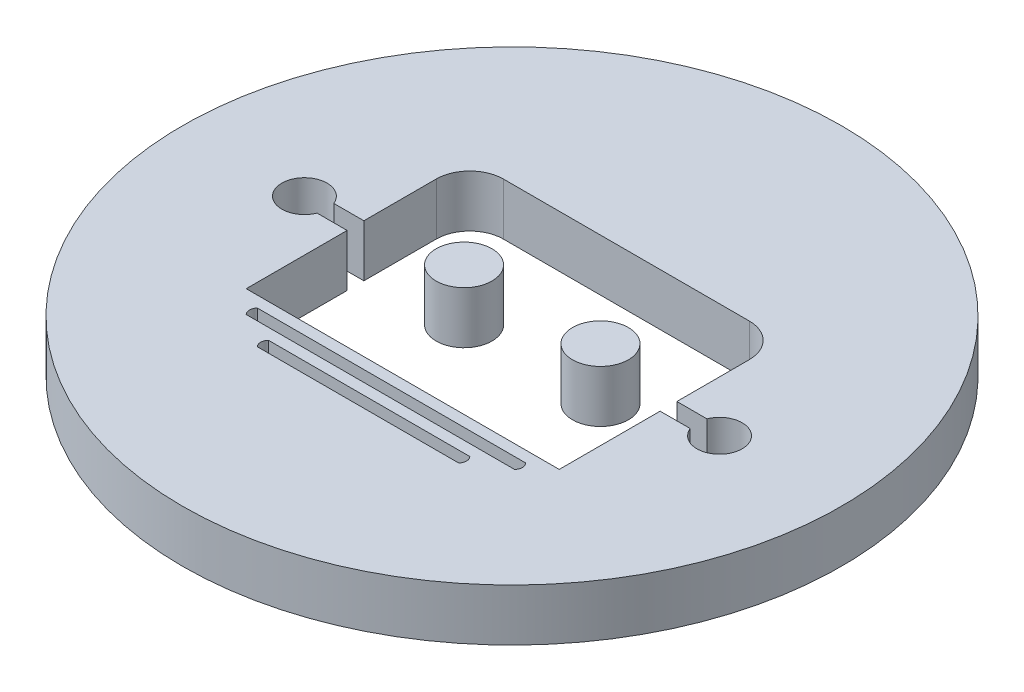
ISO-10303-21;
HEADER;
FILE_DESCRIPTION(('STEP AP214'),'2;1');
FILE_NAME('part.step','',(''),(''),'','','');
FILE_SCHEMA(('AUTOMOTIVE_DESIGN { 1 0 10303 214 1 1 1 1 }'));
ENDSEC;
DATA;
#1=APPLICATION_CONTEXT('core data for automotive mechanical design processes');
#2=APPLICATION_PROTOCOL_DEFINITION('international standard','automotive_design',2000,#1);
#3=PRODUCT_CONTEXT('',#1,'mechanical');
#4=PRODUCT('Part','Part','',(#3));
#5=PRODUCT_RELATED_PRODUCT_CATEGORY('part','',(#4));
#6=PRODUCT_DEFINITION_FORMATION('','',#4);
#7=PRODUCT_DEFINITION_CONTEXT('part definition',#1,'design');
#8=PRODUCT_DEFINITION('design','',#6,#7);
#9=PRODUCT_DEFINITION_SHAPE('','',#8);
#10=(LENGTH_UNIT() NAMED_UNIT(*) SI_UNIT(.MILLI.,.METRE.));
#11=(NAMED_UNIT(*) PLANE_ANGLE_UNIT() SI_UNIT($,.RADIAN.));
#12=(NAMED_UNIT(*) SI_UNIT($,.STERADIAN.) SOLID_ANGLE_UNIT());
#13=UNCERTAINTY_MEASURE_WITH_UNIT(LENGTH_MEASURE(1.E-05),#10,'distance_accuracy_value','');
#14=(GEOMETRIC_REPRESENTATION_CONTEXT(3) GLOBAL_UNCERTAINTY_ASSIGNED_CONTEXT((#13)) GLOBAL_UNIT_ASSIGNED_CONTEXT((#10,
#11,#12)) REPRESENTATION_CONTEXT('',''));
#15=CARTESIAN_POINT('',(0.,0.,0.));
#16=DIRECTION('',(0.,0.,1.));
#17=DIRECTION('',(1.,0.,0.));
#18=AXIS2_PLACEMENT_3D('',#15,#16,#17);
#19=CARTESIAN_POINT('',(-35.6565223605691,3.,-86.8647060918394));
#20=DIRECTION('',(0.,-1.,0.));
#21=DIRECTION('',(0.,0.,-1.));
#22=AXIS2_PLACEMENT_3D('',#19,#20,#21);
#23=CYLINDRICAL_SURFACE('',#22,19.);
#24=CARTESIAN_POINT('',(-35.6565223605691,3.,-86.8647060918394));
#25=DIRECTION('',(0.,1.,0.));
#26=DIRECTION('',(0.,0.,1.));
#27=AXIS2_PLACEMENT_3D('',#24,#25,#26);
#28=CIRCLE('',#27,19.);
#29=CARTESIAN_POINT('',(-35.6565223605691,3.,-67.8647060918394));
#30=VERTEX_POINT('',#29);
#31=EDGE_CURVE('E263',#30,#30,#28,.T.);
#32=ORIENTED_EDGE('',*,*,#31,.F.);
#33=EDGE_LOOP('',(#32));
#34=FACE_BOUND('',#33,.T.);
#35=CARTESIAN_POINT('',(-35.6565223605691,0.,-86.8647060918394));
#36=DIRECTION('',(0.,1.,0.));
#37=DIRECTION('',(0.,0.,1.));
#38=AXIS2_PLACEMENT_3D('',#35,#36,#37);
#39=CIRCLE('',#38,19.);
#40=CARTESIAN_POINT('',(-35.6565223605691,0.,-67.8647060918394));
#41=VERTEX_POINT('',#40);
#42=EDGE_CURVE('E254',#41,#41,#39,.T.);
#43=ORIENTED_EDGE('',*,*,#42,.T.);
#44=EDGE_LOOP('',(#43));
#45=FACE_BOUND('',#44,.T.);
#46=ADVANCED_FACE('F41',(#34,#45),#23,.T.);
#47=CARTESIAN_POINT('',(-35.6565223605691,3.,-86.8647060918394));
#48=DIRECTION('',(0.,1.,0.));
#49=DIRECTION('',(0.,0.,1.));
#50=AXIS2_PLACEMENT_3D('',#47,#48,#49);
#51=PLANE('',#50);
#52=CARTESIAN_POINT('',(-41.1347905407077,3.,-78.3085075817985));
#53=DIRECTION('',(0.,1.,0.));
#54=DIRECTION('',(0.,0.,1.));
#55=AXIS2_PLACEMENT_3D('',#52,#53,#54);
#56=CIRCLE('',#55,0.45573183286289);
#57=CARTESIAN_POINT('',(-41.4570416101277,3.,-78.6307586512184));
#58=VERTEX_POINT('',#57);
#59=CARTESIAN_POINT('',(-41.4570416101277,3.,-77.9862565123785));
#60=VERTEX_POINT('',#59);
#61=EDGE_CURVE('E58',#58,#60,#56,.T.);
#62=ORIENTED_EDGE('',*,*,#61,.F.);
#63=DIRECTION('',(-1.,0.,0.));
#64=VECTOR('',#63,1.);
#65=CARTESIAN_POINT('',(-41.4570416101277,3.,-78.6307586512184));
#66=LINE('',#65,#64);
#67=CARTESIAN_POINT('',(-29.8560031110105,3.,-78.6307586512184));
#68=VERTEX_POINT('',#67);
#69=EDGE_CURVE('E210',#68,#58,#66,.T.);
#70=ORIENTED_EDGE('',*,*,#69,.F.);
#71=CARTESIAN_POINT('',(-30.1782541804304,3.,-78.3085075817985));
#72=DIRECTION('',(0.,1.,0.));
#73=DIRECTION('',(0.,0.,-1.));
#74=AXIS2_PLACEMENT_3D('',#71,#72,#73);
#75=CIRCLE('',#74,0.45573183286289);
#76=CARTESIAN_POINT('',(-29.8560031110105,3.,-77.9862565123785));
#77=VERTEX_POINT('',#76);
#78=EDGE_CURVE('E213',#77,#68,#75,.T.);
#79=ORIENTED_EDGE('',*,*,#78,.F.);
#80=DIRECTION('',(1.,0.,0.));
#81=VECTOR('',#80,1.);
#82=CARTESIAN_POINT('',(-41.4570416101277,3.,-77.9862565123785));
#83=LINE('',#82,#81);
#84=EDGE_CURVE('E219',#60,#77,#83,.T.);
#85=ORIENTED_EDGE('',*,*,#84,.F.);
#86=EDGE_LOOP('',(#62,#70,#79,#85));
#87=FACE_BOUND('',#86,.T.);
#88=CARTESIAN_POINT('',(-43.0682969572273,3.,-79.5975118594782));
#89=DIRECTION('',(0.,1.,0.));
#90=DIRECTION('',(0.,0.,1.));
#91=AXIS2_PLACEMENT_3D('',#88,#89,#90);
#92=CIRCLE('',#91,0.455731832862915);
#93=CARTESIAN_POINT('',(-43.3905480266472,3.,-79.9197629288981));
#94=VERTEX_POINT('',#93);
#95=CARTESIAN_POINT('',(-43.3905480266472,3.,-79.2752607900582));
#96=VERTEX_POINT('',#95);
#97=EDGE_CURVE('E225',#94,#96,#92,.T.);
#98=ORIENTED_EDGE('',*,*,#97,.F.);
#99=DIRECTION('',(-1.,0.,0.));
#100=VECTOR('',#99,1.);
#101=CARTESIAN_POINT('',(-43.3905480266472,3.,-79.9197629288981));
#102=LINE('',#101,#100);
#103=CARTESIAN_POINT('',(-27.9224966944909,3.,-79.9197629288981));
#104=VERTEX_POINT('',#103);
#105=EDGE_CURVE('E233',#104,#94,#102,.T.);
#106=ORIENTED_EDGE('',*,*,#105,.F.);
#107=CARTESIAN_POINT('',(-28.2447477639109,3.,-79.5975118594782));
#108=DIRECTION('',(0.,1.,0.));
#109=DIRECTION('',(0.,0.,-1.));
#110=AXIS2_PLACEMENT_3D('',#107,#108,#109);
#111=CIRCLE('',#110,0.45573183286291);
#112=CARTESIAN_POINT('',(-27.9224966944909,3.,-79.2752607900582));
#113=VERTEX_POINT('',#112);
#114=EDGE_CURVE('E247',#113,#104,#111,.T.);
#115=ORIENTED_EDGE('',*,*,#114,.F.);
#116=DIRECTION('',(1.,0.,0.));
#117=VECTOR('',#116,1.);
#118=CARTESIAN_POINT('',(-43.3905480266472,3.,-79.2752607900582));
#119=LINE('',#118,#117);
#120=EDGE_CURVE('E244',#96,#113,#119,.T.);
#121=ORIENTED_EDGE('',*,*,#120,.F.);
#122=EDGE_LOOP('',(#98,#106,#115,#121));
#123=FACE_BOUND('',#122,.T.);
#124=DIRECTION('',(1.,0.,0.));
#125=VECTOR('',#124,1.);
#126=CARTESIAN_POINT('',(-26.6334924168112,3.,-80.5642650677379));
#127=LINE('',#126,#125);
#128=CARTESIAN_POINT('',(-44.6795523043269,3.,-80.5642650677379));
#129=VERTEX_POINT('',#128);
#130=CARTESIAN_POINT('',(-26.6334924168112,3.,-80.5642650677379));
#131=VERTEX_POINT('',#130);
#132=EDGE_CURVE('E305',#129,#131,#127,.T.);
#133=ORIENTED_EDGE('',*,*,#132,.F.);
#134=DIRECTION('',(0.,0.,1.));
#135=VECTOR('',#134,1.);
#136=CARTESIAN_POINT('',(-44.6795523043269,3.,-80.5642650677379));
#137=LINE('',#136,#135);
#138=CARTESIAN_POINT('',(-44.6795523043269,3.,-86.3813294877095));
#139=VERTEX_POINT('',#138);
#140=EDGE_CURVE('E302',#139,#129,#137,.T.);
#141=ORIENTED_EDGE('',*,*,#140,.F.);
#142=DIRECTION('',(1.,0.,0.));
#143=VECTOR('',#142,1.);
#144=CARTESIAN_POINT('',(-44.6795523043269,3.,-86.3813294877095));
#145=LINE('',#144,#143);
#146=CARTESIAN_POINT('',(-46.4121857606302,3.,-86.3813294877095));
#147=VERTEX_POINT('',#146);
#148=EDGE_CURVE('E299',#147,#139,#145,.T.);
#149=ORIENTED_EDGE('',*,*,#148,.F.);
#150=CARTESIAN_POINT('',(-47.6224304451511,3.,-86.8647060918394));
#151=DIRECTION('',(0.,1.,0.));
#152=DIRECTION('',(0.,0.,1.));
#153=AXIS2_PLACEMENT_3D('',#150,#151,#152);
#154=CIRCLE('',#153,1.30320571585279);
#155=CARTESIAN_POINT('',(-46.4121857606302,3.,-87.3480826959693));
#156=VERTEX_POINT('',#155);
#157=EDGE_CURVE('E296',#156,#147,#154,.T.);
#158=ORIENTED_EDGE('',*,*,#157,.F.);
#159=DIRECTION('',(-1.,0.,0.));
#160=VECTOR('',#159,1.);
#161=CARTESIAN_POINT('',(-46.4121857606302,3.,-87.3480826959693));
#162=LINE('',#161,#160);
#163=CARTESIAN_POINT('',(-44.6795523043269,3.,-87.3480826959693));
#164=VERTEX_POINT('',#163);
#165=EDGE_CURVE('E293',#164,#156,#162,.T.);
#166=ORIENTED_EDGE('',*,*,#165,.F.);
#167=DIRECTION('',(0.,0.,1.));
#168=VECTOR('',#167,1.);
#169=CARTESIAN_POINT('',(-44.6795523043269,3.,-87.3480826959693));
#170=LINE('',#169,#168);
#171=CARTESIAN_POINT('',(-44.6795523043269,3.,-91.5208014280153));
#172=VERTEX_POINT('',#171);
#173=EDGE_CURVE('E290',#172,#164,#170,.T.);
#174=ORIENTED_EDGE('',*,*,#173,.F.);
#175=CARTESIAN_POINT('',(-42.7460458878074,3.,-91.5208014280153));
#176=DIRECTION('',(0.,1.,0.));
#177=DIRECTION('',(0.,0.,1.));
#178=AXIS2_PLACEMENT_3D('',#175,#176,#177);
#179=CIRCLE('',#178,1.93350641651953);
#180=CARTESIAN_POINT('',(-42.7460458878074,3.,-93.4543078445348));
#181=VERTEX_POINT('',#180);
#182=EDGE_CURVE('E287',#181,#172,#179,.T.);
#183=ORIENTED_EDGE('',*,*,#182,.F.);
#184=DIRECTION('',(-1.,0.,0.));
#185=VECTOR('',#184,1.);
#186=CARTESIAN_POINT('',(-42.7460458878074,3.,-93.4543078445348));
#187=LINE('',#186,#185);
#188=CARTESIAN_POINT('',(-28.5669988333308,3.,-93.4543078445348));
#189=VERTEX_POINT('',#188);
#190=EDGE_CURVE('E284',#189,#181,#187,.T.);
#191=ORIENTED_EDGE('',*,*,#190,.F.);
#192=CARTESIAN_POINT('',(-28.5669988333308,3.,-91.5208014280153));
#193=DIRECTION('',(0.,1.,0.));
#194=DIRECTION('',(0.,0.,1.));
#195=AXIS2_PLACEMENT_3D('',#192,#193,#194);
#196=CIRCLE('',#195,1.93350641651954);
#197=CARTESIAN_POINT('',(-26.6334924168112,3.,-91.5208014280153));
#198=VERTEX_POINT('',#197);
#199=EDGE_CURVE('E281',#198,#189,#196,.T.);
#200=ORIENTED_EDGE('',*,*,#199,.F.);
#201=DIRECTION('',(0.,0.,-1.));
#202=VECTOR('',#201,1.);
#203=CARTESIAN_POINT('',(-26.6334924168112,3.,-91.5208014280153));
#204=LINE('',#203,#202);
#205=CARTESIAN_POINT('',(-26.6334924168112,3.,-87.3480826959693));
#206=VERTEX_POINT('',#205);
#207=EDGE_CURVE('E278',#206,#198,#204,.T.);
#208=ORIENTED_EDGE('',*,*,#207,.F.);
#209=DIRECTION('',(-1.,0.,0.));
#210=VECTOR('',#209,1.);
#211=CARTESIAN_POINT('',(-26.6334924168112,3.,-87.3480826959693));
#212=LINE('',#211,#210);
#213=CARTESIAN_POINT('',(-24.9008589605079,3.,-87.3480826959693));
#214=VERTEX_POINT('',#213);
#215=EDGE_CURVE('E275',#214,#206,#212,.T.);
#216=ORIENTED_EDGE('',*,*,#215,.F.);
#217=CARTESIAN_POINT('',(-23.690614275987,3.,-86.8647060918394));
#218=DIRECTION('',(0.,1.,0.));
#219=DIRECTION('',(0.,0.,1.));
#220=AXIS2_PLACEMENT_3D('',#217,#218,#219);
#221=CIRCLE('',#220,1.30320571585279);
#222=CARTESIAN_POINT('',(-24.9008589605079,3.,-86.3813294877095));
#223=VERTEX_POINT('',#222);
#224=EDGE_CURVE('E272',#223,#214,#221,.T.);
#225=ORIENTED_EDGE('',*,*,#224,.F.);
#226=DIRECTION('',(1.,0.,0.));
#227=VECTOR('',#226,1.);
#228=CARTESIAN_POINT('',(-24.9008589605079,3.,-86.3813294877095));
#229=LINE('',#228,#227);
#230=CARTESIAN_POINT('',(-26.6334924168112,3.,-86.3813294877095));
#231=VERTEX_POINT('',#230);
#232=EDGE_CURVE('E269',#231,#223,#229,.T.);
#233=ORIENTED_EDGE('',*,*,#232,.F.);
#234=DIRECTION('',(0.,0.,-1.));
#235=VECTOR('',#234,1.);
#236=CARTESIAN_POINT('',(-26.6334924168112,3.,-86.3813294877095));
#237=LINE('',#236,#235);
#238=EDGE_CURVE('E50',#131,#231,#237,.T.);
#239=ORIENTED_EDGE('',*,*,#238,.F.);
#240=EDGE_LOOP('',(#133,#141,#149,#158,#166,#174,#183,#191,#200,#208,#216,#225,#233,#239));
#241=FACE_BOUND('',#240,.T.);
#242=ORIENTED_EDGE('',*,*,#31,.T.);
#243=EDGE_LOOP('',(#242));
#244=FACE_BOUND('',#243,.T.);
#245=ADVANCED_FACE('F43',(#87,#123,#241,#244),#51,.T.);
#246=CARTESIAN_POINT('',(-35.6565223605691,0.,-86.8647060918394));
#247=DIRECTION('',(0.,1.,0.));
#248=DIRECTION('',(0.,0.,1.));
#249=AXIS2_PLACEMENT_3D('',#246,#247,#248);
#250=PLANE('',#249);
#251=DIRECTION('',(-1.,0.,0.));
#252=VECTOR('',#251,1.);
#253=CARTESIAN_POINT('',(-41.4570416101277,0.,-78.6307586512184));
#254=LINE('',#253,#252);
#255=CARTESIAN_POINT('',(-29.8560031110105,0.,-78.6307586512184));
#256=VERTEX_POINT('',#255);
#257=CARTESIAN_POINT('',(-41.4570416101277,0.,-78.6307586512184));
#258=VERTEX_POINT('',#257);
#259=EDGE_CURVE('E200',#256,#258,#254,.T.);
#260=ORIENTED_EDGE('',*,*,#259,.T.);
#261=CARTESIAN_POINT('',(-41.1347905407077,0.,-78.3085075817985));
#262=DIRECTION('',(0.,1.,0.));
#263=DIRECTION('',(0.,0.,1.));
#264=AXIS2_PLACEMENT_3D('',#261,#262,#263);
#265=CIRCLE('',#264,0.45573183286289);
#266=CARTESIAN_POINT('',(-41.4570416101277,0.,-77.9862565123785));
#267=VERTEX_POINT('',#266);
#268=EDGE_CURVE('E194',#258,#267,#265,.T.);
#269=ORIENTED_EDGE('',*,*,#268,.T.);
#270=DIRECTION('',(1.,0.,0.));
#271=VECTOR('',#270,1.);
#272=CARTESIAN_POINT('',(-41.4570416101277,0.,-77.9862565123785));
#273=LINE('',#272,#271);
#274=CARTESIAN_POINT('',(-29.8560031110105,0.,-77.9862565123785));
#275=VERTEX_POINT('',#274);
#276=EDGE_CURVE('E203',#267,#275,#273,.T.);
#277=ORIENTED_EDGE('',*,*,#276,.T.);
#278=CARTESIAN_POINT('',(-30.1782541804304,0.,-78.3085075817985));
#279=DIRECTION('',(0.,1.,0.));
#280=DIRECTION('',(0.,0.,-1.));
#281=AXIS2_PLACEMENT_3D('',#278,#279,#280);
#282=CIRCLE('',#281,0.45573183286289);
#283=EDGE_CURVE('E66',#275,#256,#282,.T.);
#284=ORIENTED_EDGE('',*,*,#283,.T.);
#285=EDGE_LOOP('',(#260,#269,#277,#284));
#286=FACE_BOUND('',#285,.T.);
#287=DIRECTION('',(-1.,0.,0.));
#288=VECTOR('',#287,1.);
#289=CARTESIAN_POINT('',(-43.3905480266472,0.,-79.9197629288981));
#290=LINE('',#289,#288);
#291=CARTESIAN_POINT('',(-27.9224966944909,0.,-79.9197629288981));
#292=VERTEX_POINT('',#291);
#293=CARTESIAN_POINT('',(-43.3905480266472,0.,-79.9197629288981));
#294=VERTEX_POINT('',#293);
#295=EDGE_CURVE('E239',#292,#294,#290,.T.);
#296=ORIENTED_EDGE('',*,*,#295,.T.);
#297=CARTESIAN_POINT('',(-43.0682969572273,0.,-79.5975118594782));
#298=DIRECTION('',(0.,1.,0.));
#299=DIRECTION('',(0.,0.,1.));
#300=AXIS2_PLACEMENT_3D('',#297,#298,#299);
#301=CIRCLE('',#300,0.455731832862915);
#302=CARTESIAN_POINT('',(-43.3905480266472,0.,-79.2752607900582));
#303=VERTEX_POINT('',#302);
#304=EDGE_CURVE('E229',#294,#303,#301,.T.);
#305=ORIENTED_EDGE('',*,*,#304,.T.);
#306=DIRECTION('',(1.,0.,0.));
#307=VECTOR('',#306,1.);
#308=CARTESIAN_POINT('',(-43.3905480266472,0.,-79.2752607900582));
#309=LINE('',#308,#307);
#310=CARTESIAN_POINT('',(-27.9224966944909,0.,-79.2752607900582));
#311=VERTEX_POINT('',#310);
#312=EDGE_CURVE('E232',#303,#311,#309,.T.);
#313=ORIENTED_EDGE('',*,*,#312,.T.);
#314=CARTESIAN_POINT('',(-28.2447477639109,0.,-79.5975118594782));
#315=DIRECTION('',(0.,1.,0.));
#316=DIRECTION('',(0.,0.,-1.));
#317=AXIS2_PLACEMENT_3D('',#314,#315,#316);
#318=CIRCLE('',#317,0.45573183286291);
#319=EDGE_CURVE('E236',#311,#292,#318,.T.);
#320=ORIENTED_EDGE('',*,*,#319,.T.);
#321=EDGE_LOOP('',(#296,#305,#313,#320));
#322=FACE_BOUND('',#321,.T.);
#323=DIRECTION('',(0.,0.,1.));
#324=VECTOR('',#323,1.);
#325=CARTESIAN_POINT('',(-44.6795523043269,0.,-80.5642650677379));
#326=LINE('',#325,#324);
#327=CARTESIAN_POINT('',(-44.6795523043269,0.,-86.3813294877095));
#328=VERTEX_POINT('',#327);
#329=CARTESIAN_POINT('',(-44.6795523043269,0.,-80.5642650677379));
#330=VERTEX_POINT('',#329);
#331=EDGE_CURVE('E265',#328,#330,#326,.T.);
#332=ORIENTED_EDGE('',*,*,#331,.T.);
#333=DIRECTION('',(1.,0.,0.));
#334=VECTOR('',#333,1.);
#335=CARTESIAN_POINT('',(-26.6334924168112,0.,-80.5642650677379));
#336=LINE('',#335,#334);
#337=CARTESIAN_POINT('',(-26.6334924168112,0.,-80.5642650677379));
#338=VERTEX_POINT('',#337);
#339=EDGE_CURVE('E45',#330,#338,#336,.T.);
#340=ORIENTED_EDGE('',*,*,#339,.T.);
#341=DIRECTION('',(0.,0.,-1.));
#342=VECTOR('',#341,1.);
#343=CARTESIAN_POINT('',(-26.6334924168112,0.,-86.3813294877095));
#344=LINE('',#343,#342);
#345=CARTESIAN_POINT('',(-26.6334924168112,0.,-86.3813294877095));
#346=VERTEX_POINT('',#345);
#347=EDGE_CURVE('E367',#338,#346,#344,.T.);
#348=ORIENTED_EDGE('',*,*,#347,.T.);
#349=DIRECTION('',(1.,0.,0.));
#350=VECTOR('',#349,1.);
#351=CARTESIAN_POINT('',(-24.9008589605079,0.,-86.3813294877095));
#352=LINE('',#351,#350);
#353=CARTESIAN_POINT('',(-24.9008589605079,0.,-86.3813294877095));
#354=VERTEX_POINT('',#353);
#355=EDGE_CURVE('E365',#346,#354,#352,.T.);
#356=ORIENTED_EDGE('',*,*,#355,.T.);
#357=CARTESIAN_POINT('',(-23.690614275987,0.,-86.8647060918394));
#358=DIRECTION('',(0.,1.,0.));
#359=DIRECTION('',(0.,0.,1.));
#360=AXIS2_PLACEMENT_3D('',#357,#358,#359);
#361=CIRCLE('',#360,1.30320571585279);
#362=CARTESIAN_POINT('',(-24.9008589605079,0.,-87.3480826959693));
#363=VERTEX_POINT('',#362);
#364=EDGE_CURVE('E362',#354,#363,#361,.T.);
#365=ORIENTED_EDGE('',*,*,#364,.T.);
#366=DIRECTION('',(-1.,0.,0.));
#367=VECTOR('',#366,1.);
#368=CARTESIAN_POINT('',(-26.6334924168112,0.,-87.3480826959693));
#369=LINE('',#368,#367);
#370=CARTESIAN_POINT('',(-26.6334924168112,0.,-87.3480826959693));
#371=VERTEX_POINT('',#370);
#372=EDGE_CURVE('E359',#363,#371,#369,.T.);
#373=ORIENTED_EDGE('',*,*,#372,.T.);
#374=DIRECTION('',(0.,0.,-1.));
#375=VECTOR('',#374,1.);
#376=CARTESIAN_POINT('',(-26.6334924168112,0.,-91.5208014280153));
#377=LINE('',#376,#375);
#378=CARTESIAN_POINT('',(-26.6334924168112,0.,-91.5208014280153));
#379=VERTEX_POINT('',#378);
#380=EDGE_CURVE('E356',#371,#379,#377,.T.);
#381=ORIENTED_EDGE('',*,*,#380,.T.);
#382=CARTESIAN_POINT('',(-28.5669988333308,0.,-91.5208014280153));
#383=DIRECTION('',(0.,1.,0.));
#384=DIRECTION('',(0.,0.,1.));
#385=AXIS2_PLACEMENT_3D('',#382,#383,#384);
#386=CIRCLE('',#385,1.93350641651954);
#387=CARTESIAN_POINT('',(-28.5669988333308,0.,-93.4543078445348));
#388=VERTEX_POINT('',#387);
#389=EDGE_CURVE('E353',#379,#388,#386,.T.);
#390=ORIENTED_EDGE('',*,*,#389,.T.);
#391=DIRECTION('',(-1.,0.,0.));
#392=VECTOR('',#391,1.);
#393=CARTESIAN_POINT('',(-42.7460458878074,0.,-93.4543078445348));
#394=LINE('',#393,#392);
#395=CARTESIAN_POINT('',(-42.7460458878074,0.,-93.4543078445348));
#396=VERTEX_POINT('',#395);
#397=EDGE_CURVE('E350',#388,#396,#394,.T.);
#398=ORIENTED_EDGE('',*,*,#397,.T.);
#399=CARTESIAN_POINT('',(-42.7460458878074,0.,-91.5208014280153));
#400=DIRECTION('',(0.,1.,0.));
#401=DIRECTION('',(0.,0.,1.));
#402=AXIS2_PLACEMENT_3D('',#399,#400,#401);
#403=CIRCLE('',#402,1.93350641651953);
#404=CARTESIAN_POINT('',(-44.6795523043269,0.,-91.5208014280153));
#405=VERTEX_POINT('',#404);
#406=EDGE_CURVE('E347',#396,#405,#403,.T.);
#407=ORIENTED_EDGE('',*,*,#406,.T.);
#408=DIRECTION('',(0.,0.,1.));
#409=VECTOR('',#408,1.);
#410=CARTESIAN_POINT('',(-44.6795523043269,0.,-87.3480826959693));
#411=LINE('',#410,#409);
#412=CARTESIAN_POINT('',(-44.6795523043269,0.,-87.3480826959693));
#413=VERTEX_POINT('',#412);
#414=EDGE_CURVE('E344',#405,#413,#411,.T.);
#415=ORIENTED_EDGE('',*,*,#414,.T.);
#416=DIRECTION('',(-1.,0.,0.));
#417=VECTOR('',#416,1.);
#418=CARTESIAN_POINT('',(-46.4121857606302,0.,-87.3480826959693));
#419=LINE('',#418,#417);
#420=CARTESIAN_POINT('',(-46.4121857606302,0.,-87.3480826959693));
#421=VERTEX_POINT('',#420);
#422=EDGE_CURVE('E341',#413,#421,#419,.T.);
#423=ORIENTED_EDGE('',*,*,#422,.T.);
#424=CARTESIAN_POINT('',(-47.6224304451511,0.,-86.8647060918394));
#425=DIRECTION('',(0.,1.,0.));
#426=DIRECTION('',(0.,0.,1.));
#427=AXIS2_PLACEMENT_3D('',#424,#425,#426);
#428=CIRCLE('',#427,1.30320571585279);
#429=CARTESIAN_POINT('',(-46.4121857606302,0.,-86.3813294877095));
#430=VERTEX_POINT('',#429);
#431=EDGE_CURVE('E338',#421,#430,#428,.T.);
#432=ORIENTED_EDGE('',*,*,#431,.T.);
#433=DIRECTION('',(1.,0.,0.));
#434=VECTOR('',#433,1.);
#435=CARTESIAN_POINT('',(-44.6795523043269,0.,-86.3813294877095));
#436=LINE('',#435,#434);
#437=EDGE_CURVE('E333',#430,#328,#436,.T.);
#438=ORIENTED_EDGE('',*,*,#437,.T.);
#439=EDGE_LOOP('',(#332,#340,#348,#356,#365,#373,#381,#390,#398,#407,#415,#423,#432,#438));
#440=FACE_BOUND('',#439,.T.);
#441=ORIENTED_EDGE('',*,*,#42,.F.);
#442=EDGE_LOOP('',(#441));
#443=FACE_BOUND('',#442,.T.);
#444=ADVANCED_FACE('F207',(#286,#322,#440,#443),#250,.F.);
#445=CARTESIAN_POINT('',(-26.6334924168112,0.,-80.5642650677379));
#446=DIRECTION('',(0.,0.,1.));
#447=DIRECTION('',(1.,0.,0.));
#448=AXIS2_PLACEMENT_3D('',#445,#446,#447);
#449=PLANE('',#448);
#450=ORIENTED_EDGE('',*,*,#132,.T.);
#451=DIRECTION('',(0.,1.,0.));
#452=VECTOR('',#451,1.);
#453=CARTESIAN_POINT('',(-26.6334924168112,0.,-80.5642650677379));
#454=LINE('',#453,#452);
#455=EDGE_CURVE('E12',#338,#131,#454,.T.);
#456=ORIENTED_EDGE('',*,*,#455,.F.);
#457=ORIENTED_EDGE('',*,*,#339,.F.);
#458=DIRECTION('',(0.,1.,0.));
#459=VECTOR('',#458,1.);
#460=CARTESIAN_POINT('',(-44.6795523043269,0.,-80.5642650677379));
#461=LINE('',#460,#459);
#462=EDGE_CURVE('E303',#330,#129,#461,.T.);
#463=ORIENTED_EDGE('',*,*,#462,.T.);
#464=EDGE_LOOP('',(#450,#456,#457,#463));
#465=FACE_BOUND('',#464,.T.);
#466=ADVANCED_FACE('F376',(#465),#449,.F.);
#467=CARTESIAN_POINT('',(-44.6795523043269,0.,-80.5642650677379));
#468=DIRECTION('',(-1.,0.,0.));
#469=DIRECTION('',(0.,0.,1.));
#470=AXIS2_PLACEMENT_3D('',#467,#468,#469);
#471=PLANE('',#470);
#472=ORIENTED_EDGE('',*,*,#140,.T.);
#473=ORIENTED_EDGE('',*,*,#462,.F.);
#474=ORIENTED_EDGE('',*,*,#331,.F.);
#475=DIRECTION('',(0.,1.,0.));
#476=VECTOR('',#475,1.);
#477=CARTESIAN_POINT('',(-44.6795523043269,0.,-86.3813294877095));
#478=LINE('',#477,#476);
#479=EDGE_CURVE('E300',#328,#139,#478,.T.);
#480=ORIENTED_EDGE('',*,*,#479,.T.);
#481=EDGE_LOOP('',(#472,#473,#474,#480));
#482=FACE_BOUND('',#481,.T.);
#483=ADVANCED_FACE('F427',(#482),#471,.F.);
#484=CARTESIAN_POINT('',(-44.6795523043269,0.,-86.3813294877095));
#485=DIRECTION('',(0.,0.,1.));
#486=DIRECTION('',(1.,0.,0.));
#487=AXIS2_PLACEMENT_3D('',#484,#485,#486);
#488=PLANE('',#487);
#489=ORIENTED_EDGE('',*,*,#148,.T.);
#490=ORIENTED_EDGE('',*,*,#479,.F.);
#491=ORIENTED_EDGE('',*,*,#437,.F.);
#492=DIRECTION('',(0.,1.,0.));
#493=VECTOR('',#492,1.);
#494=CARTESIAN_POINT('',(-46.4121857606302,0.,-86.3813294877095));
#495=LINE('',#494,#493);
#496=EDGE_CURVE('E297',#430,#147,#495,.T.);
#497=ORIENTED_EDGE('',*,*,#496,.T.);
#498=EDGE_LOOP('',(#489,#490,#491,#497));
#499=FACE_BOUND('',#498,.T.);
#500=ADVANCED_FACE('F423',(#499),#488,.F.);
#501=CARTESIAN_POINT('',(-47.6224304451511,0.,-86.8647060918394));
#502=DIRECTION('',(0.,1.,0.));
#503=DIRECTION('',(0.,0.,1.));
#504=AXIS2_PLACEMENT_3D('',#501,#502,#503);
#505=CYLINDRICAL_SURFACE('',#504,1.30320571585279);
#506=ORIENTED_EDGE('',*,*,#157,.T.);
#507=ORIENTED_EDGE('',*,*,#496,.F.);
#508=ORIENTED_EDGE('',*,*,#431,.F.);
#509=DIRECTION('',(0.,1.,0.));
#510=VECTOR('',#509,1.);
#511=CARTESIAN_POINT('',(-46.4121857606302,0.,-87.3480826959693));
#512=LINE('',#511,#510);
#513=EDGE_CURVE('E294',#421,#156,#512,.T.);
#514=ORIENTED_EDGE('',*,*,#513,.T.);
#515=EDGE_LOOP('',(#506,#507,#508,#514));
#516=FACE_BOUND('',#515,.T.);
#517=ADVANCED_FACE('F420',(#516),#505,.F.);
#518=CARTESIAN_POINT('',(-46.4121857606302,0.,-87.3480826959693));
#519=DIRECTION('',(0.,0.,-1.));
#520=DIRECTION('',(-1.,0.,0.));
#521=AXIS2_PLACEMENT_3D('',#518,#519,#520);
#522=PLANE('',#521);
#523=ORIENTED_EDGE('',*,*,#165,.T.);
#524=ORIENTED_EDGE('',*,*,#513,.F.);
#525=ORIENTED_EDGE('',*,*,#422,.F.);
#526=DIRECTION('',(0.,1.,0.));
#527=VECTOR('',#526,1.);
#528=CARTESIAN_POINT('',(-44.6795523043269,0.,-87.3480826959693));
#529=LINE('',#528,#527);
#530=EDGE_CURVE('E291',#413,#164,#529,.T.);
#531=ORIENTED_EDGE('',*,*,#530,.T.);
#532=EDGE_LOOP('',(#523,#524,#525,#531));
#533=FACE_BOUND('',#532,.T.);
#534=ADVANCED_FACE('F416',(#533),#522,.F.);
#535=CARTESIAN_POINT('',(-44.6795523043269,0.,-87.3480826959693));
#536=DIRECTION('',(-1.,0.,0.));
#537=DIRECTION('',(0.,0.,1.));
#538=AXIS2_PLACEMENT_3D('',#535,#536,#537);
#539=PLANE('',#538);
#540=ORIENTED_EDGE('',*,*,#173,.T.);
#541=ORIENTED_EDGE('',*,*,#530,.F.);
#542=ORIENTED_EDGE('',*,*,#414,.F.);
#543=DIRECTION('',(0.,1.,0.));
#544=VECTOR('',#543,1.);
#545=CARTESIAN_POINT('',(-44.6795523043269,0.,-91.5208014280153));
#546=LINE('',#545,#544);
#547=EDGE_CURVE('E288',#405,#172,#546,.T.);
#548=ORIENTED_EDGE('',*,*,#547,.T.);
#549=EDGE_LOOP('',(#540,#541,#542,#548));
#550=FACE_BOUND('',#549,.T.);
#551=ADVANCED_FACE('F412',(#550),#539,.F.);
#552=CARTESIAN_POINT('',(-42.7460458878074,0.,-91.5208014280153));
#553=DIRECTION('',(0.,1.,0.));
#554=DIRECTION('',(0.,0.,1.));
#555=AXIS2_PLACEMENT_3D('',#552,#553,#554);
#556=CYLINDRICAL_SURFACE('',#555,1.93350641651953);
#557=ORIENTED_EDGE('',*,*,#182,.T.);
#558=ORIENTED_EDGE('',*,*,#547,.F.);
#559=ORIENTED_EDGE('',*,*,#406,.F.);
#560=DIRECTION('',(0.,1.,0.));
#561=VECTOR('',#560,1.);
#562=CARTESIAN_POINT('',(-42.7460458878074,0.,-93.4543078445348));
#563=LINE('',#562,#561);
#564=EDGE_CURVE('E285',#396,#181,#563,.T.);
#565=ORIENTED_EDGE('',*,*,#564,.T.);
#566=EDGE_LOOP('',(#557,#558,#559,#565));
#567=FACE_BOUND('',#566,.T.);
#568=ADVANCED_FACE('F408',(#567),#556,.F.);
#569=CARTESIAN_POINT('',(-42.7460458878074,0.,-93.4543078445348));
#570=DIRECTION('',(0.,0.,-1.));
#571=DIRECTION('',(-1.,0.,0.));
#572=AXIS2_PLACEMENT_3D('',#569,#570,#571);
#573=PLANE('',#572);
#574=ORIENTED_EDGE('',*,*,#190,.T.);
#575=ORIENTED_EDGE('',*,*,#564,.F.);
#576=ORIENTED_EDGE('',*,*,#397,.F.);
#577=DIRECTION('',(0.,1.,0.));
#578=VECTOR('',#577,1.);
#579=CARTESIAN_POINT('',(-28.5669988333308,0.,-93.4543078445348));
#580=LINE('',#579,#578);
#581=EDGE_CURVE('E282',#388,#189,#580,.T.);
#582=ORIENTED_EDGE('',*,*,#581,.T.);
#583=EDGE_LOOP('',(#574,#575,#576,#582));
#584=FACE_BOUND('',#583,.T.);
#585=ADVANCED_FACE('F404',(#584),#573,.F.);
#586=CARTESIAN_POINT('',(-28.5669988333308,0.,-91.5208014280153));
#587=DIRECTION('',(0.,1.,0.));
#588=DIRECTION('',(0.,0.,1.));
#589=AXIS2_PLACEMENT_3D('',#586,#587,#588);
#590=CYLINDRICAL_SURFACE('',#589,1.93350641651954);
#591=ORIENTED_EDGE('',*,*,#199,.T.);
#592=ORIENTED_EDGE('',*,*,#581,.F.);
#593=ORIENTED_EDGE('',*,*,#389,.F.);
#594=DIRECTION('',(0.,1.,0.));
#595=VECTOR('',#594,1.);
#596=CARTESIAN_POINT('',(-26.6334924168112,0.,-91.5208014280153));
#597=LINE('',#596,#595);
#598=EDGE_CURVE('E279',#379,#198,#597,.T.);
#599=ORIENTED_EDGE('',*,*,#598,.T.);
#600=EDGE_LOOP('',(#591,#592,#593,#599));
#601=FACE_BOUND('',#600,.T.);
#602=ADVANCED_FACE('F400',(#601),#590,.F.);
#603=CARTESIAN_POINT('',(-26.6334924168112,0.,-91.5208014280153));
#604=DIRECTION('',(1.,0.,0.));
#605=DIRECTION('',(0.,0.,-1.));
#606=AXIS2_PLACEMENT_3D('',#603,#604,#605);
#607=PLANE('',#606);
#608=ORIENTED_EDGE('',*,*,#207,.T.);
#609=ORIENTED_EDGE('',*,*,#598,.F.);
#610=ORIENTED_EDGE('',*,*,#380,.F.);
#611=DIRECTION('',(0.,1.,0.));
#612=VECTOR('',#611,1.);
#613=CARTESIAN_POINT('',(-26.6334924168112,0.,-87.3480826959693));
#614=LINE('',#613,#612);
#615=EDGE_CURVE('E276',#371,#206,#614,.T.);
#616=ORIENTED_EDGE('',*,*,#615,.T.);
#617=EDGE_LOOP('',(#608,#609,#610,#616));
#618=FACE_BOUND('',#617,.T.);
#619=ADVANCED_FACE('F396',(#618),#607,.F.);
#620=CARTESIAN_POINT('',(-26.6334924168112,0.,-87.3480826959693));
#621=DIRECTION('',(0.,0.,-1.));
#622=DIRECTION('',(-1.,0.,0.));
#623=AXIS2_PLACEMENT_3D('',#620,#621,#622);
#624=PLANE('',#623);
#625=ORIENTED_EDGE('',*,*,#215,.T.);
#626=ORIENTED_EDGE('',*,*,#615,.F.);
#627=ORIENTED_EDGE('',*,*,#372,.F.);
#628=DIRECTION('',(0.,1.,0.));
#629=VECTOR('',#628,1.);
#630=CARTESIAN_POINT('',(-24.9008589605079,0.,-87.3480826959693));
#631=LINE('',#630,#629);
#632=EDGE_CURVE('E273',#363,#214,#631,.T.);
#633=ORIENTED_EDGE('',*,*,#632,.T.);
#634=EDGE_LOOP('',(#625,#626,#627,#633));
#635=FACE_BOUND('',#634,.T.);
#636=ADVANCED_FACE('F392',(#635),#624,.F.);
#637=CARTESIAN_POINT('',(-23.690614275987,0.,-86.8647060918394));
#638=DIRECTION('',(0.,1.,0.));
#639=DIRECTION('',(0.,0.,1.));
#640=AXIS2_PLACEMENT_3D('',#637,#638,#639);
#641=CYLINDRICAL_SURFACE('',#640,1.30320571585279);
#642=ORIENTED_EDGE('',*,*,#224,.T.);
#643=ORIENTED_EDGE('',*,*,#632,.F.);
#644=ORIENTED_EDGE('',*,*,#364,.F.);
#645=DIRECTION('',(0.,1.,0.));
#646=VECTOR('',#645,1.);
#647=CARTESIAN_POINT('',(-24.9008589605079,0.,-86.3813294877095));
#648=LINE('',#647,#646);
#649=EDGE_CURVE('E270',#354,#223,#648,.T.);
#650=ORIENTED_EDGE('',*,*,#649,.T.);
#651=EDGE_LOOP('',(#642,#643,#644,#650));
#652=FACE_BOUND('',#651,.T.);
#653=ADVANCED_FACE('F389',(#652),#641,.F.);
#654=CARTESIAN_POINT('',(-24.9008589605079,0.,-86.3813294877095));
#655=DIRECTION('',(0.,0.,1.));
#656=DIRECTION('',(1.,0.,0.));
#657=AXIS2_PLACEMENT_3D('',#654,#655,#656);
#658=PLANE('',#657);
#659=ORIENTED_EDGE('',*,*,#232,.T.);
#660=ORIENTED_EDGE('',*,*,#649,.F.);
#661=ORIENTED_EDGE('',*,*,#355,.F.);
#662=DIRECTION('',(0.,1.,0.));
#663=VECTOR('',#662,1.);
#664=CARTESIAN_POINT('',(-26.6334924168112,0.,-86.3813294877095));
#665=LINE('',#664,#663);
#666=EDGE_CURVE('E267',#346,#231,#665,.T.);
#667=ORIENTED_EDGE('',*,*,#666,.T.);
#668=EDGE_LOOP('',(#659,#660,#661,#667));
#669=FACE_BOUND('',#668,.T.);
#670=ADVANCED_FACE('F384',(#669),#658,.F.);
#671=CARTESIAN_POINT('',(-26.6334924168112,0.,-86.3813294877095));
#672=DIRECTION('',(1.,0.,0.));
#673=DIRECTION('',(0.,0.,-1.));
#674=AXIS2_PLACEMENT_3D('',#671,#672,#673);
#675=PLANE('',#674);
#676=ORIENTED_EDGE('',*,*,#238,.T.);
#677=ORIENTED_EDGE('',*,*,#666,.F.);
#678=ORIENTED_EDGE('',*,*,#347,.F.);
#679=ORIENTED_EDGE('',*,*,#455,.T.);
#680=EDGE_LOOP('',(#676,#677,#678,#679));
#681=FACE_BOUND('',#680,.T.);
#682=ADVANCED_FACE('F381',(#681),#675,.F.);
#683=CARTESIAN_POINT('',(-43.0682969572273,0.,-79.5975118594782));
#684=DIRECTION('',(0.,1.,0.));
#685=DIRECTION('',(0.,0.,1.));
#686=AXIS2_PLACEMENT_3D('',#683,#684,#685);
#687=CYLINDRICAL_SURFACE('',#686,0.455731832862915);
#688=ORIENTED_EDGE('',*,*,#97,.T.);
#689=DIRECTION('',(0.,1.,0.));
#690=VECTOR('',#689,1.);
#691=CARTESIAN_POINT('',(-43.3905480266472,0.,-79.2752607900582));
#692=LINE('',#691,#690);
#693=EDGE_CURVE('E242',#303,#96,#692,.T.);
#694=ORIENTED_EDGE('',*,*,#693,.F.);
#695=ORIENTED_EDGE('',*,*,#304,.F.);
#696=DIRECTION('',(0.,1.,0.));
#697=VECTOR('',#696,1.);
#698=CARTESIAN_POINT('',(-43.3905480266472,0.,-79.9197629288981));
#699=LINE('',#698,#697);
#700=EDGE_CURVE('E252',#294,#94,#699,.T.);
#701=ORIENTED_EDGE('',*,*,#700,.T.);
#702=EDGE_LOOP('',(#688,#694,#695,#701));
#703=FACE_BOUND('',#702,.T.);
#704=ADVANCED_FACE('F469',(#703),#687,.F.);
#705=CARTESIAN_POINT('',(-43.3905480266472,0.,-79.9197629288981));
#706=DIRECTION('',(0.,0.,-1.));
#707=DIRECTION('',(-1.,0.,0.));
#708=AXIS2_PLACEMENT_3D('',#705,#706,#707);
#709=PLANE('',#708);
#710=ORIENTED_EDGE('',*,*,#105,.T.);
#711=ORIENTED_EDGE('',*,*,#700,.F.);
#712=ORIENTED_EDGE('',*,*,#295,.F.);
#713=DIRECTION('',(0.,1.,0.));
#714=VECTOR('',#713,1.);
#715=CARTESIAN_POINT('',(-27.9224966944909,0.,-79.9197629288981));
#716=LINE('',#715,#714);
#717=EDGE_CURVE('E255',#292,#104,#716,.T.);
#718=ORIENTED_EDGE('',*,*,#717,.T.);
#719=EDGE_LOOP('',(#710,#711,#712,#718));
#720=FACE_BOUND('',#719,.T.);
#721=ADVANCED_FACE('F473',(#720),#709,.F.);
#722=CARTESIAN_POINT('',(-28.2447477639109,0.,-79.5975118594782));
#723=DIRECTION('',(0.,1.,0.));
#724=DIRECTION('',(0.,0.,1.));
#725=AXIS2_PLACEMENT_3D('',#722,#723,#724);
#726=CYLINDRICAL_SURFACE('',#725,0.45573183286291);
#727=ORIENTED_EDGE('',*,*,#114,.T.);
#728=ORIENTED_EDGE('',*,*,#717,.F.);
#729=ORIENTED_EDGE('',*,*,#319,.F.);
#730=DIRECTION('',(0.,1.,0.));
#731=VECTOR('',#730,1.);
#732=CARTESIAN_POINT('',(-27.9224966944909,0.,-79.2752607900582));
#733=LINE('',#732,#731);
#734=EDGE_CURVE('E257',#311,#113,#733,.T.);
#735=ORIENTED_EDGE('',*,*,#734,.T.);
#736=EDGE_LOOP('',(#727,#728,#729,#735));
#737=FACE_BOUND('',#736,.T.);
#738=ADVANCED_FACE('F478',(#737),#726,.F.);
#739=CARTESIAN_POINT('',(-43.3905480266472,0.,-79.2752607900582));
#740=DIRECTION('',(0.,0.,1.));
#741=DIRECTION('',(1.,0.,0.));
#742=AXIS2_PLACEMENT_3D('',#739,#740,#741);
#743=PLANE('',#742);
#744=ORIENTED_EDGE('',*,*,#120,.T.);
#745=ORIENTED_EDGE('',*,*,#734,.F.);
#746=ORIENTED_EDGE('',*,*,#312,.F.);
#747=ORIENTED_EDGE('',*,*,#693,.T.);
#748=EDGE_LOOP('',(#744,#745,#746,#747));
#749=FACE_BOUND('',#748,.T.);
#750=ADVANCED_FACE('F475',(#749),#743,.F.);
#751=CARTESIAN_POINT('',(-41.1347905407077,0.,-78.3085075817985));
#752=DIRECTION('',(0.,1.,0.));
#753=DIRECTION('',(0.,0.,1.));
#754=AXIS2_PLACEMENT_3D('',#751,#752,#753);
#755=CYLINDRICAL_SURFACE('',#754,0.45573183286289);
#756=ORIENTED_EDGE('',*,*,#61,.T.);
#757=DIRECTION('',(0.,1.,0.));
#758=VECTOR('',#757,1.);
#759=CARTESIAN_POINT('',(-41.4570416101277,0.,-77.9862565123785));
#760=LINE('',#759,#758);
#761=EDGE_CURVE('E190',#267,#60,#760,.T.);
#762=ORIENTED_EDGE('',*,*,#761,.F.);
#763=ORIENTED_EDGE('',*,*,#268,.F.);
#764=DIRECTION('',(0.,1.,0.));
#765=VECTOR('',#764,1.);
#766=CARTESIAN_POINT('',(-41.4570416101277,0.,-78.6307586512184));
#767=LINE('',#766,#765);
#768=EDGE_CURVE('E223',#258,#58,#767,.T.);
#769=ORIENTED_EDGE('',*,*,#768,.T.);
#770=EDGE_LOOP('',(#756,#762,#763,#769));
#771=FACE_BOUND('',#770,.T.);
#772=ADVANCED_FACE('F192',(#771),#755,.F.);
#773=CARTESIAN_POINT('',(-41.4570416101277,0.,-78.6307586512184));
#774=DIRECTION('',(0.,0.,-1.));
#775=DIRECTION('',(-1.,0.,0.));
#776=AXIS2_PLACEMENT_3D('',#773,#774,#775);
#777=PLANE('',#776);
#778=ORIENTED_EDGE('',*,*,#69,.T.);
#779=ORIENTED_EDGE('',*,*,#768,.F.);
#780=ORIENTED_EDGE('',*,*,#259,.F.);
#781=DIRECTION('',(0.,1.,0.));
#782=VECTOR('',#781,1.);
#783=CARTESIAN_POINT('',(-29.8560031110105,0.,-78.6307586512184));
#784=LINE('',#783,#782);
#785=EDGE_CURVE('E226',#256,#68,#784,.T.);
#786=ORIENTED_EDGE('',*,*,#785,.T.);
#787=EDGE_LOOP('',(#778,#779,#780,#786));
#788=FACE_BOUND('',#787,.T.);
#789=ADVANCED_FACE('F488',(#788),#777,.F.);
#790=CARTESIAN_POINT('',(-30.1782541804304,0.,-78.3085075817985));
#791=DIRECTION('',(0.,1.,0.));
#792=DIRECTION('',(0.,0.,1.));
#793=AXIS2_PLACEMENT_3D('',#790,#791,#792);
#794=CYLINDRICAL_SURFACE('',#793,0.45573183286289);
#795=ORIENTED_EDGE('',*,*,#78,.T.);
#796=ORIENTED_EDGE('',*,*,#785,.F.);
#797=ORIENTED_EDGE('',*,*,#283,.F.);
#798=DIRECTION('',(0.,1.,0.));
#799=VECTOR('',#798,1.);
#800=CARTESIAN_POINT('',(-29.8560031110105,0.,-77.9862565123785));
#801=LINE('',#800,#799);
#802=EDGE_CURVE('E199',#275,#77,#801,.T.);
#803=ORIENTED_EDGE('',*,*,#802,.T.);
#804=EDGE_LOOP('',(#795,#796,#797,#803));
#805=FACE_BOUND('',#804,.T.);
#806=ADVANCED_FACE('F491',(#805),#794,.F.);
#807=CARTESIAN_POINT('',(-41.4570416101277,0.,-77.9862565123785));
#808=DIRECTION('',(0.,0.,1.));
#809=DIRECTION('',(1.,0.,0.));
#810=AXIS2_PLACEMENT_3D('',#807,#808,#809);
#811=PLANE('',#810);
#812=ORIENTED_EDGE('',*,*,#84,.T.);
#813=ORIENTED_EDGE('',*,*,#802,.F.);
#814=ORIENTED_EDGE('',*,*,#276,.F.);
#815=ORIENTED_EDGE('',*,*,#761,.T.);
#816=EDGE_LOOP('',(#812,#813,#814,#815));
#817=FACE_BOUND('',#816,.T.);
#818=ADVANCED_FACE('F204',(#817),#811,.F.);
#819=CLOSED_SHELL('',(#46,#245,#444,#466,#483,#500,#517,#534,#551,#568,#585,#602,#619,#636,#653,
#670,#682,#704,#721,#738,#750,#772,#789,#806,#818));
#820=MANIFOLD_SOLID_BREP('B2',#819);
#821=CARTESIAN_POINT('',(-35.6565223605691,0.,-86.8647060918394));
#822=DIRECTION('',(0.,1.,0.));
#823=DIRECTION('',(0.,0.,1.));
#824=AXIS2_PLACEMENT_3D('',#821,#822,#823);
#825=PLANE('',#824);
#826=CARTESIAN_POINT('',(-31.7246524604709,0.,-88.0326600883949));
#827=DIRECTION('',(0.,1.,0.));
#828=DIRECTION('',(0.,0.,1.));
#829=AXIS2_PLACEMENT_3D('',#826,#827,#828);
#830=CIRCLE('',#829,1.61125534709959);
#831=CARTESIAN_POINT('',(-31.7246524604709,0.,-86.4214047412953));
#832=VERTEX_POINT('',#831);
#833=EDGE_CURVE('E668',#832,#832,#830,.T.);
#834=ORIENTED_EDGE('',*,*,#833,.F.);
#835=EDGE_LOOP('',(#834));
#836=FACE_BOUND('',#835,.T.);
#837=ADVANCED_FACE('F664',(#836),#825,.F.);
#838=CARTESIAN_POINT('',(-31.7246524604709,0.,-88.0326600883949));
#839=DIRECTION('',(0.,1.,0.));
#840=DIRECTION('',(0.,0.,1.));
#841=AXIS2_PLACEMENT_3D('',#838,#839,#840);
#842=CYLINDRICAL_SURFACE('',#841,1.61125534709959);
#843=ORIENTED_EDGE('',*,*,#833,.T.);
#844=EDGE_LOOP('',(#843));
#845=FACE_BOUND('',#844,.T.);
#846=CARTESIAN_POINT('',(-31.7246524604709,3.,-88.0326600883949));
#847=DIRECTION('',(0.,1.,0.));
#848=DIRECTION('',(0.,0.,1.));
#849=AXIS2_PLACEMENT_3D('',#846,#847,#848);
#850=CIRCLE('',#849,1.61125534709959);
#851=CARTESIAN_POINT('',(-31.7246524604709,3.,-86.4214047412953));
#852=VERTEX_POINT('',#851);
#853=EDGE_CURVE('E40',#852,#852,#850,.T.);
#854=ORIENTED_EDGE('',*,*,#853,.F.);
#855=EDGE_LOOP('',(#854));
#856=FACE_BOUND('',#855,.T.);
#857=ADVANCED_FACE('F677',(#845,#856),#842,.T.);
#858=CARTESIAN_POINT('',(-35.6565223605691,3.,-86.8647060918394));
#859=DIRECTION('',(0.,1.,0.));
#860=DIRECTION('',(0.,0.,1.));
#861=AXIS2_PLACEMENT_3D('',#858,#859,#860);
#862=PLANE('',#861);
#863=ORIENTED_EDGE('',*,*,#853,.T.);
#864=EDGE_LOOP('',(#863));
#865=FACE_BOUND('',#864,.T.);
#866=ADVANCED_FACE('F666',(#865),#862,.T.);
#867=CLOSED_SHELL('',(#837,#857,#866));
#868=MANIFOLD_SOLID_BREP('B6',#867);
#869=CARTESIAN_POINT('',(-35.6565223605691,0.,-86.8647060918394));
#870=DIRECTION('',(0.,1.,0.));
#871=DIRECTION('',(0.,0.,1.));
#872=AXIS2_PLACEMENT_3D('',#869,#870,#871);
#873=PLANE('',#872);
#874=CARTESIAN_POINT('',(-39.5883922606672,0.,-88.0326600883949));
#875=DIRECTION('',(0.,1.,0.));
#876=DIRECTION('',(0.,0.,1.));
#877=AXIS2_PLACEMENT_3D('',#874,#875,#876);
#878=CIRCLE('',#877,1.61125534709962);
#879=CARTESIAN_POINT('',(-39.5883922606672,0.,-86.4214047412952));
#880=VERTEX_POINT('',#879);
#881=EDGE_CURVE('E663',#880,#880,#878,.T.);
#882=ORIENTED_EDGE('',*,*,#881,.F.);
#883=EDGE_LOOP('',(#882));
#884=FACE_BOUND('',#883,.T.);
#885=ADVANCED_FACE('F704',(#884),#873,.F.);
#886=CARTESIAN_POINT('',(-39.5883922606672,0.,-88.0326600883949));
#887=DIRECTION('',(0.,1.,0.));
#888=DIRECTION('',(0.,0.,1.));
#889=AXIS2_PLACEMENT_3D('',#886,#887,#888);
#890=CYLINDRICAL_SURFACE('',#889,1.61125534709962);
#891=ORIENTED_EDGE('',*,*,#881,.T.);
#892=EDGE_LOOP('',(#891));
#893=FACE_BOUND('',#892,.T.);
#894=CARTESIAN_POINT('',(-39.5883922606672,3.,-88.0326600883949));
#895=DIRECTION('',(0.,1.,0.));
#896=DIRECTION('',(0.,0.,1.));
#897=AXIS2_PLACEMENT_3D('',#894,#895,#896);
#898=CIRCLE('',#897,1.61125534709962);
#899=CARTESIAN_POINT('',(-39.5883922606672,3.,-86.4214047412952));
#900=VERTEX_POINT('',#899);
#901=EDGE_CURVE('E707',#900,#900,#898,.T.);
#902=ORIENTED_EDGE('',*,*,#901,.F.);
#903=EDGE_LOOP('',(#902));
#904=FACE_BOUND('',#903,.T.);
#905=ADVANCED_FACE('F718',(#893,#904),#890,.T.);
#906=CARTESIAN_POINT('',(-35.6565223605691,3.,-86.8647060918394));
#907=DIRECTION('',(0.,1.,0.));
#908=DIRECTION('',(0.,0.,1.));
#909=AXIS2_PLACEMENT_3D('',#906,#907,#908);
#910=PLANE('',#909);
#911=ORIENTED_EDGE('',*,*,#901,.T.);
#912=EDGE_LOOP('',(#911));
#913=FACE_BOUND('',#912,.T.);
#914=ADVANCED_FACE('F716',(#913),#910,.T.);
#915=CLOSED_SHELL('',(#885,#905,#914));
#916=MANIFOLD_SOLID_BREP('B35',#915);
#917=ADVANCED_BREP_SHAPE_REPRESENTATION('',(#18,#820,#868,#916),#14);
#918=SHAPE_DEFINITION_REPRESENTATION(#9,#917);
ENDSEC;
END-ISO-10303-21;
